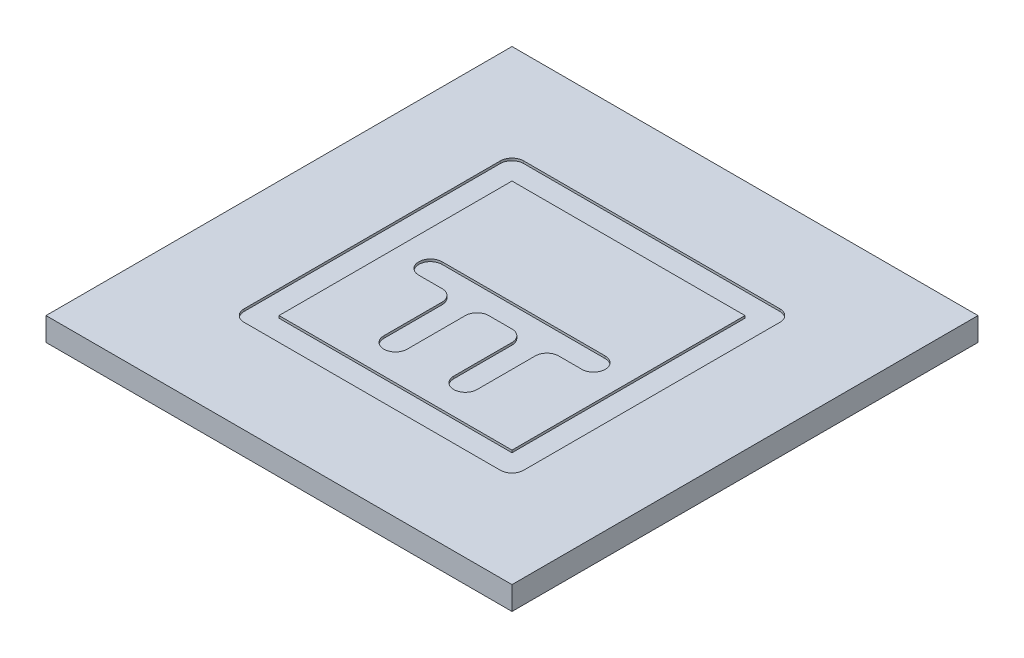
ISO-10303-21;
HEADER;
FILE_DESCRIPTION(('STEP AP214'),'2;1');
FILE_NAME('part.step','',(''),(''),'','','');
FILE_SCHEMA(('AUTOMOTIVE_DESIGN { 1 0 10303 214 1 1 1 1 }'));
ENDSEC;
DATA;
#1=APPLICATION_CONTEXT('core data for automotive mechanical design processes');
#2=APPLICATION_PROTOCOL_DEFINITION('international standard','automotive_design',2000,#1);
#3=PRODUCT_CONTEXT('',#1,'mechanical');
#4=PRODUCT('Part','Part','',(#3));
#5=PRODUCT_RELATED_PRODUCT_CATEGORY('part','',(#4));
#6=PRODUCT_DEFINITION_FORMATION('','',#4);
#7=PRODUCT_DEFINITION_CONTEXT('part definition',#1,'design');
#8=PRODUCT_DEFINITION('design','',#6,#7);
#9=PRODUCT_DEFINITION_SHAPE('','',#8);
#10=(LENGTH_UNIT() NAMED_UNIT(*) SI_UNIT(.MILLI.,.METRE.));
#11=(NAMED_UNIT(*) PLANE_ANGLE_UNIT() SI_UNIT($,.RADIAN.));
#12=(NAMED_UNIT(*) SI_UNIT($,.STERADIAN.) SOLID_ANGLE_UNIT());
#13=UNCERTAINTY_MEASURE_WITH_UNIT(LENGTH_MEASURE(1.E-05),#10,'distance_accuracy_value','');
#14=(GEOMETRIC_REPRESENTATION_CONTEXT(3) GLOBAL_UNCERTAINTY_ASSIGNED_CONTEXT((#13)) GLOBAL_UNIT_ASSIGNED_CONTEXT((#10,
#11,#12)) REPRESENTATION_CONTEXT('',''));
#15=CARTESIAN_POINT('',(0.,0.,0.));
#16=DIRECTION('',(0.,0.,1.));
#17=DIRECTION('',(1.,0.,0.));
#18=AXIS2_PLACEMENT_3D('',#15,#16,#17);
#19=CARTESIAN_POINT('',(0.,10.,0.));
#20=DIRECTION('',(0.,1.,0.));
#21=DIRECTION('',(0.,0.,1.));
#22=AXIS2_PLACEMENT_3D('',#19,#20,#21);
#23=PLANE('',#22);
#24=DIRECTION('',(0.,0.,1.));
#25=VECTOR('',#24,1.);
#26=CARTESIAN_POINT('',(-100.,10.,100.));
#27=LINE('',#26,#25);
#28=CARTESIAN_POINT('',(-100.,10.,-100.));
#29=VERTEX_POINT('',#28);
#30=CARTESIAN_POINT('',(-100.,10.,100.));
#31=VERTEX_POINT('',#30);
#32=EDGE_CURVE('E432',#29,#31,#27,.T.);
#33=ORIENTED_EDGE('',*,*,#32,.T.);
#34=DIRECTION('',(1.,0.,0.));
#35=VECTOR('',#34,1.);
#36=CARTESIAN_POINT('',(100.,10.,100.));
#37=LINE('',#36,#35);
#38=CARTESIAN_POINT('',(100.,10.,100.));
#39=VERTEX_POINT('',#38);
#40=EDGE_CURVE('E435',#31,#39,#37,.T.);
#41=ORIENTED_EDGE('',*,*,#40,.T.);
#42=DIRECTION('',(0.,0.,-1.));
#43=VECTOR('',#42,1.);
#44=CARTESIAN_POINT('',(100.,10.,100.));
#45=LINE('',#44,#43);
#46=CARTESIAN_POINT('',(100.,10.,-100.));
#47=VERTEX_POINT('',#46);
#48=EDGE_CURVE('E438',#39,#47,#45,.T.);
#49=ORIENTED_EDGE('',*,*,#48,.T.);
#50=DIRECTION('',(-1.,0.,0.));
#51=VECTOR('',#50,1.);
#52=CARTESIAN_POINT('',(100.,10.,-100.));
#53=LINE('',#52,#51);
#54=EDGE_CURVE('E440',#47,#29,#53,.T.);
#55=ORIENTED_EDGE('',*,*,#54,.T.);
#56=EDGE_LOOP('',(#33,#41,#49,#55));
#57=FACE_BOUND('',#56,.T.);
#58=DIRECTION('',(0.,0.,-1.));
#59=VECTOR('',#58,1.);
#60=CARTESIAN_POINT('',(60.,10.,0.));
#61=LINE('',#60,#59);
#62=CARTESIAN_POINT('',(60.,10.,55.));
#63=VERTEX_POINT('',#62);
#64=CARTESIAN_POINT('',(60.,10.,-55.));
#65=VERTEX_POINT('',#64);
#66=EDGE_CURVE('E326',#63,#65,#61,.T.);
#67=ORIENTED_EDGE('',*,*,#66,.F.);
#68=CARTESIAN_POINT('',(55.,10.,55.));
#69=DIRECTION('',(0.,1.,0.));
#70=DIRECTION('',(0.,0.,1.));
#71=AXIS2_PLACEMENT_3D('',#68,#69,#70);
#72=CIRCLE('',#71,5.);
#73=CARTESIAN_POINT('',(55.,10.,60.));
#74=VERTEX_POINT('',#73);
#75=EDGE_CURVE('E526',#63,#74,#72,.F.);
#76=ORIENTED_EDGE('',*,*,#75,.T.);
#77=DIRECTION('',(-1.,0.,0.));
#78=VECTOR('',#77,1.);
#79=CARTESIAN_POINT('',(0.,10.,60.));
#80=LINE('',#79,#78);
#81=CARTESIAN_POINT('',(-55.,10.,60.));
#82=VERTEX_POINT('',#81);
#83=EDGE_CURVE('E323',#74,#82,#80,.T.);
#84=ORIENTED_EDGE('',*,*,#83,.T.);
#85=CARTESIAN_POINT('',(-55.,10.,55.));
#86=DIRECTION('',(0.,1.,0.));
#87=DIRECTION('',(0.,0.,1.));
#88=AXIS2_PLACEMENT_3D('',#85,#86,#87);
#89=CIRCLE('',#88,5.);
#90=CARTESIAN_POINT('',(-60.,10.,55.));
#91=VERTEX_POINT('',#90);
#92=EDGE_CURVE('E524',#82,#91,#89,.F.);
#93=ORIENTED_EDGE('',*,*,#92,.T.);
#94=DIRECTION('',(0.,0.,-1.));
#95=VECTOR('',#94,1.);
#96=CARTESIAN_POINT('',(-60.,10.,0.));
#97=LINE('',#96,#95);
#98=CARTESIAN_POINT('',(-60.,10.,-55.));
#99=VERTEX_POINT('',#98);
#100=EDGE_CURVE('E321',#91,#99,#97,.T.);
#101=ORIENTED_EDGE('',*,*,#100,.T.);
#102=CARTESIAN_POINT('',(-55.,10.,-55.));
#103=DIRECTION('',(0.,1.,0.));
#104=DIRECTION('',(0.,0.,1.));
#105=AXIS2_PLACEMENT_3D('',#102,#103,#104);
#106=CIRCLE('',#105,5.);
#107=CARTESIAN_POINT('',(-55.,10.,-60.));
#108=VERTEX_POINT('',#107);
#109=EDGE_CURVE('E12',#99,#108,#106,.F.);
#110=ORIENTED_EDGE('',*,*,#109,.T.);
#111=DIRECTION('',(-1.,0.,0.));
#112=VECTOR('',#111,1.);
#113=CARTESIAN_POINT('',(0.,10.,-60.));
#114=LINE('',#113,#112);
#115=CARTESIAN_POINT('',(55.,10.,-60.));
#116=VERTEX_POINT('',#115);
#117=EDGE_CURVE('E329',#116,#108,#114,.T.);
#118=ORIENTED_EDGE('',*,*,#117,.F.);
#119=CARTESIAN_POINT('',(55.,10.,-55.));
#120=DIRECTION('',(0.,1.,0.));
#121=DIRECTION('',(0.,0.,1.));
#122=AXIS2_PLACEMENT_3D('',#119,#120,#121);
#123=CIRCLE('',#122,5.);
#124=EDGE_CURVE('E89',#116,#65,#123,.F.);
#125=ORIENTED_EDGE('',*,*,#124,.T.);
#126=EDGE_LOOP('',(#67,#76,#84,#93,#101,#110,#118,#125));
#127=FACE_BOUND('',#126,.T.);
#128=ADVANCED_FACE('F81',(#57,#127),#23,.T.);
#129=CARTESIAN_POINT('',(-100.,10.,100.));
#130=DIRECTION('',(1.,0.,0.));
#131=DIRECTION('',(0.,0.,-1.));
#132=AXIS2_PLACEMENT_3D('',#129,#130,#131);
#133=PLANE('',#132);
#134=DIRECTION('',(0.,0.,1.));
#135=VECTOR('',#134,1.);
#136=CARTESIAN_POINT('',(-100.,0.,100.));
#137=LINE('',#136,#135);
#138=CARTESIAN_POINT('',(-100.,0.,-100.));
#139=VERTEX_POINT('',#138);
#140=CARTESIAN_POINT('',(-100.,0.,100.));
#141=VERTEX_POINT('',#140);
#142=EDGE_CURVE('E413',#139,#141,#137,.T.);
#143=ORIENTED_EDGE('',*,*,#142,.T.);
#144=DIRECTION('',(0.,-1.,0.));
#145=VECTOR('',#144,1.);
#146=CARTESIAN_POINT('',(-100.,10.,100.));
#147=LINE('',#146,#145);
#148=EDGE_CURVE('E458',#31,#141,#147,.T.);
#149=ORIENTED_EDGE('',*,*,#148,.F.);
#150=ORIENTED_EDGE('',*,*,#32,.F.);
#151=DIRECTION('',(0.,-1.,0.));
#152=VECTOR('',#151,1.);
#153=CARTESIAN_POINT('',(-100.,10.,-100.));
#154=LINE('',#153,#152);
#155=EDGE_CURVE('E442',#29,#139,#154,.T.);
#156=ORIENTED_EDGE('',*,*,#155,.T.);
#157=EDGE_LOOP('',(#143,#149,#150,#156));
#158=FACE_BOUND('',#157,.T.);
#159=ADVANCED_FACE('F574',(#158),#133,.F.);
#160=CARTESIAN_POINT('',(100.,10.,100.));
#161=DIRECTION('',(0.,0.,-1.));
#162=DIRECTION('',(-1.,0.,0.));
#163=AXIS2_PLACEMENT_3D('',#160,#161,#162);
#164=PLANE('',#163);
#165=DIRECTION('',(1.,0.,0.));
#166=VECTOR('',#165,1.);
#167=CARTESIAN_POINT('',(100.,0.,100.));
#168=LINE('',#167,#166);
#169=CARTESIAN_POINT('',(100.,0.,100.));
#170=VERTEX_POINT('',#169);
#171=EDGE_CURVE('E445',#141,#170,#168,.T.);
#172=ORIENTED_EDGE('',*,*,#171,.T.);
#173=DIRECTION('',(0.,-1.,0.));
#174=VECTOR('',#173,1.);
#175=CARTESIAN_POINT('',(100.,10.,100.));
#176=LINE('',#175,#174);
#177=EDGE_CURVE('E455',#39,#170,#176,.T.);
#178=ORIENTED_EDGE('',*,*,#177,.F.);
#179=ORIENTED_EDGE('',*,*,#40,.F.);
#180=ORIENTED_EDGE('',*,*,#148,.T.);
#181=EDGE_LOOP('',(#172,#178,#179,#180));
#182=FACE_BOUND('',#181,.T.);
#183=ADVANCED_FACE('F581',(#182),#164,.F.);
#184=CARTESIAN_POINT('',(100.,10.,100.));
#185=DIRECTION('',(-1.,0.,0.));
#186=DIRECTION('',(0.,0.,1.));
#187=AXIS2_PLACEMENT_3D('',#184,#185,#186);
#188=PLANE('',#187);
#189=DIRECTION('',(0.,0.,-1.));
#190=VECTOR('',#189,1.);
#191=CARTESIAN_POINT('',(100.,0.,100.));
#192=LINE('',#191,#190);
#193=CARTESIAN_POINT('',(100.,0.,-100.));
#194=VERTEX_POINT('',#193);
#195=EDGE_CURVE('E447',#170,#194,#192,.T.);
#196=ORIENTED_EDGE('',*,*,#195,.T.);
#197=DIRECTION('',(0.,-1.,0.));
#198=VECTOR('',#197,1.);
#199=CARTESIAN_POINT('',(100.,10.,-100.));
#200=LINE('',#199,#198);
#201=EDGE_CURVE('E452',#47,#194,#200,.T.);
#202=ORIENTED_EDGE('',*,*,#201,.F.);
#203=ORIENTED_EDGE('',*,*,#48,.F.);
#204=ORIENTED_EDGE('',*,*,#177,.T.);
#205=EDGE_LOOP('',(#196,#202,#203,#204));
#206=FACE_BOUND('',#205,.T.);
#207=ADVANCED_FACE('F782',(#206),#188,.F.);
#208=CARTESIAN_POINT('',(100.,10.,-100.));
#209=DIRECTION('',(0.,0.,1.));
#210=DIRECTION('',(1.,0.,0.));
#211=AXIS2_PLACEMENT_3D('',#208,#209,#210);
#212=PLANE('',#211);
#213=DIRECTION('',(-1.,0.,0.));
#214=VECTOR('',#213,1.);
#215=CARTESIAN_POINT('',(100.,0.,-100.));
#216=LINE('',#215,#214);
#217=EDGE_CURVE('E436',#194,#139,#216,.T.);
#218=ORIENTED_EDGE('',*,*,#217,.T.);
#219=ORIENTED_EDGE('',*,*,#155,.F.);
#220=ORIENTED_EDGE('',*,*,#54,.F.);
#221=ORIENTED_EDGE('',*,*,#201,.T.);
#222=EDGE_LOOP('',(#218,#219,#220,#221));
#223=FACE_BOUND('',#222,.T.);
#224=ADVANCED_FACE('F786',(#223),#212,.F.);
#225=CARTESIAN_POINT('',(0.,0.,0.));
#226=DIRECTION('',(0.,1.,0.));
#227=DIRECTION('',(0.,0.,1.));
#228=AXIS2_PLACEMENT_3D('',#225,#226,#227);
#229=PLANE('',#228);
#230=ORIENTED_EDGE('',*,*,#142,.F.);
#231=ORIENTED_EDGE('',*,*,#217,.F.);
#232=ORIENTED_EDGE('',*,*,#195,.F.);
#233=ORIENTED_EDGE('',*,*,#171,.F.);
#234=EDGE_LOOP('',(#230,#231,#232,#233));
#235=FACE_BOUND('',#234,.T.);
#236=ADVANCED_FACE('F789',(#235),#229,.F.);
#237=CARTESIAN_POINT('',(0.,9.,50.));
#238=DIRECTION('',(0.,0.,-1.));
#239=DIRECTION('',(-1.,0.,0.));
#240=AXIS2_PLACEMENT_3D('',#237,#238,#239);
#241=PLANE('',#240);
#242=DIRECTION('',(-1.,0.,0.));
#243=VECTOR('',#242,1.);
#244=CARTESIAN_POINT('',(0.,10.,50.));
#245=LINE('',#244,#243);
#246=CARTESIAN_POINT('',(50.,10.,50.));
#247=VERTEX_POINT('',#246);
#248=CARTESIAN_POINT('',(-50.,10.,50.));
#249=VERTEX_POINT('',#248);
#250=EDGE_CURVE('E295',#247,#249,#245,.T.);
#251=ORIENTED_EDGE('',*,*,#250,.T.);
#252=DIRECTION('',(0.,1.,0.));
#253=VECTOR('',#252,1.);
#254=CARTESIAN_POINT('',(-50.,9.,50.));
#255=LINE('',#254,#253);
#256=CARTESIAN_POINT('',(-50.,9.,50.));
#257=VERTEX_POINT('',#256);
#258=EDGE_CURVE('E289',#257,#249,#255,.T.);
#259=ORIENTED_EDGE('',*,*,#258,.F.);
#260=DIRECTION('',(-1.,0.,0.));
#261=VECTOR('',#260,1.);
#262=CARTESIAN_POINT('',(0.,9.,50.));
#263=LINE('',#262,#261);
#264=CARTESIAN_POINT('',(50.,9.,50.));
#265=VERTEX_POINT('',#264);
#266=EDGE_CURVE('E293',#265,#257,#263,.T.);
#267=ORIENTED_EDGE('',*,*,#266,.F.);
#268=DIRECTION('',(0.,1.,0.));
#269=VECTOR('',#268,1.);
#270=CARTESIAN_POINT('',(50.,9.,50.));
#271=LINE('',#270,#269);
#272=EDGE_CURVE('E341',#265,#247,#271,.T.);
#273=ORIENTED_EDGE('',*,*,#272,.T.);
#274=EDGE_LOOP('',(#251,#259,#267,#273));
#275=FACE_BOUND('',#274,.T.);
#276=ADVANCED_FACE('F291',(#275),#241,.F.);
#277=CARTESIAN_POINT('',(50.,9.,0.));
#278=DIRECTION('',(1.,0.,0.));
#279=DIRECTION('',(0.,0.,-1.));
#280=AXIS2_PLACEMENT_3D('',#277,#278,#279);
#281=PLANE('',#280);
#282=DIRECTION('',(0.,0.,-1.));
#283=VECTOR('',#282,1.);
#284=CARTESIAN_POINT('',(50.,10.,0.));
#285=LINE('',#284,#283);
#286=CARTESIAN_POINT('',(50.,10.,-50.));
#287=VERTEX_POINT('',#286);
#288=EDGE_CURVE('E337',#247,#287,#285,.T.);
#289=ORIENTED_EDGE('',*,*,#288,.F.);
#290=ORIENTED_EDGE('',*,*,#272,.F.);
#291=DIRECTION('',(0.,0.,-1.));
#292=VECTOR('',#291,1.);
#293=CARTESIAN_POINT('',(50.,9.,0.));
#294=LINE('',#293,#292);
#295=CARTESIAN_POINT('',(50.,9.,-50.));
#296=VERTEX_POINT('',#295);
#297=EDGE_CURVE('E300',#265,#296,#294,.T.);
#298=ORIENTED_EDGE('',*,*,#297,.T.);
#299=DIRECTION('',(0.,1.,0.));
#300=VECTOR('',#299,1.);
#301=CARTESIAN_POINT('',(50.,9.,-50.));
#302=LINE('',#301,#300);
#303=EDGE_CURVE('E344',#296,#287,#302,.T.);
#304=ORIENTED_EDGE('',*,*,#303,.T.);
#305=EDGE_LOOP('',(#289,#290,#298,#304));
#306=FACE_BOUND('',#305,.T.);
#307=ADVANCED_FACE('F796',(#306),#281,.T.);
#308=CARTESIAN_POINT('',(0.,9.,-50.));
#309=DIRECTION('',(0.,0.,-1.));
#310=DIRECTION('',(-1.,0.,0.));
#311=AXIS2_PLACEMENT_3D('',#308,#309,#310);
#312=PLANE('',#311);
#313=DIRECTION('',(-1.,0.,0.));
#314=VECTOR('',#313,1.);
#315=CARTESIAN_POINT('',(0.,10.,-50.));
#316=LINE('',#315,#314);
#317=CARTESIAN_POINT('',(-50.,10.,-50.));
#318=VERTEX_POINT('',#317);
#319=EDGE_CURVE('E334',#287,#318,#316,.T.);
#320=ORIENTED_EDGE('',*,*,#319,.F.);
#321=ORIENTED_EDGE('',*,*,#303,.F.);
#322=DIRECTION('',(-1.,0.,0.));
#323=VECTOR('',#322,1.);
#324=CARTESIAN_POINT('',(0.,9.,-50.));
#325=LINE('',#324,#323);
#326=CARTESIAN_POINT('',(-50.,9.,-50.));
#327=VERTEX_POINT('',#326);
#328=EDGE_CURVE('E307',#296,#327,#325,.T.);
#329=ORIENTED_EDGE('',*,*,#328,.T.);
#330=DIRECTION('',(0.,1.,0.));
#331=VECTOR('',#330,1.);
#332=CARTESIAN_POINT('',(-50.,9.,-50.));
#333=LINE('',#332,#331);
#334=EDGE_CURVE('E299',#327,#318,#333,.T.);
#335=ORIENTED_EDGE('',*,*,#334,.T.);
#336=EDGE_LOOP('',(#320,#321,#329,#335));
#337=FACE_BOUND('',#336,.T.);
#338=ADVANCED_FACE('F811',(#337),#312,.T.);
#339=CARTESIAN_POINT('',(-60.,9.,0.));
#340=DIRECTION('',(1.,0.,0.));
#341=DIRECTION('',(0.,0.,-1.));
#342=AXIS2_PLACEMENT_3D('',#339,#340,#341);
#343=PLANE('',#342);
#344=ORIENTED_EDGE('',*,*,#100,.F.);
#345=DIRECTION('',(0.,1.,0.));
#346=VECTOR('',#345,1.);
#347=CARTESIAN_POINT('',(-60.,9.,55.));
#348=LINE('',#347,#346);
#349=CARTESIAN_POINT('',(-60.,9.,55.));
#350=VERTEX_POINT('',#349);
#351=EDGE_CURVE('E497',#91,#350,#348,.F.);
#352=ORIENTED_EDGE('',*,*,#351,.T.);
#353=DIRECTION('',(0.,0.,-1.));
#354=VECTOR('',#353,1.);
#355=CARTESIAN_POINT('',(-60.,9.,0.));
#356=LINE('',#355,#354);
#357=CARTESIAN_POINT('',(-60.,9.,-55.));
#358=VERTEX_POINT('',#357);
#359=EDGE_CURVE('E340',#350,#358,#356,.T.);
#360=ORIENTED_EDGE('',*,*,#359,.T.);
#361=DIRECTION('',(0.,1.,0.));
#362=VECTOR('',#361,1.);
#363=CARTESIAN_POINT('',(-60.,9.,-55.));
#364=LINE('',#363,#362);
#365=EDGE_CURVE('E494',#358,#99,#364,.T.);
#366=ORIENTED_EDGE('',*,*,#365,.T.);
#367=EDGE_LOOP('',(#344,#352,#360,#366));
#368=FACE_BOUND('',#367,.T.);
#369=ADVANCED_FACE('F548',(#368),#343,.T.);
#370=CARTESIAN_POINT('',(0.,9.,-60.));
#371=DIRECTION('',(0.,0.,-1.));
#372=DIRECTION('',(-1.,0.,0.));
#373=AXIS2_PLACEMENT_3D('',#370,#371,#372);
#374=PLANE('',#373);
#375=DIRECTION('',(-1.,0.,0.));
#376=VECTOR('',#375,1.);
#377=CARTESIAN_POINT('',(0.,9.,-60.));
#378=LINE('',#377,#376);
#379=CARTESIAN_POINT('',(55.,9.,-60.));
#380=VERTEX_POINT('',#379);
#381=CARTESIAN_POINT('',(-55.,9.,-60.));
#382=VERTEX_POINT('',#381);
#383=EDGE_CURVE('E312',#380,#382,#378,.T.);
#384=ORIENTED_EDGE('',*,*,#383,.F.);
#385=DIRECTION('',(0.,1.,0.));
#386=VECTOR('',#385,1.);
#387=CARTESIAN_POINT('',(55.,10.,-60.));
#388=LINE('',#387,#386);
#389=EDGE_CURVE('E514',#380,#116,#388,.T.);
#390=ORIENTED_EDGE('',*,*,#389,.T.);
#391=ORIENTED_EDGE('',*,*,#117,.T.);
#392=DIRECTION('',(0.,1.,0.));
#393=VECTOR('',#392,1.);
#394=CARTESIAN_POINT('',(-55.,9.,-60.));
#395=LINE('',#394,#393);
#396=EDGE_CURVE('E512',#108,#382,#395,.F.);
#397=ORIENTED_EDGE('',*,*,#396,.T.);
#398=EDGE_LOOP('',(#384,#390,#391,#397));
#399=FACE_BOUND('',#398,.T.);
#400=ADVANCED_FACE('F540',(#399),#374,.F.);
#401=CARTESIAN_POINT('',(60.,9.,0.));
#402=DIRECTION('',(1.,0.,0.));
#403=DIRECTION('',(0.,0.,-1.));
#404=AXIS2_PLACEMENT_3D('',#401,#402,#403);
#405=PLANE('',#404);
#406=DIRECTION('',(0.,0.,-1.));
#407=VECTOR('',#406,1.);
#408=CARTESIAN_POINT('',(60.,9.,0.));
#409=LINE('',#408,#407);
#410=CARTESIAN_POINT('',(60.,9.,55.));
#411=VERTEX_POINT('',#410);
#412=CARTESIAN_POINT('',(60.,9.,-55.));
#413=VERTEX_POINT('',#412);
#414=EDGE_CURVE('E315',#411,#413,#409,.T.);
#415=ORIENTED_EDGE('',*,*,#414,.F.);
#416=DIRECTION('',(0.,1.,0.));
#417=VECTOR('',#416,1.);
#418=CARTESIAN_POINT('',(60.,9.,55.));
#419=LINE('',#418,#417);
#420=EDGE_CURVE('E509',#411,#63,#419,.T.);
#421=ORIENTED_EDGE('',*,*,#420,.T.);
#422=ORIENTED_EDGE('',*,*,#66,.T.);
#423=DIRECTION('',(0.,1.,0.));
#424=VECTOR('',#423,1.);
#425=CARTESIAN_POINT('',(60.,9.,-55.));
#426=LINE('',#425,#424);
#427=EDGE_CURVE('E507',#65,#413,#426,.F.);
#428=ORIENTED_EDGE('',*,*,#427,.T.);
#429=EDGE_LOOP('',(#415,#421,#422,#428));
#430=FACE_BOUND('',#429,.T.);
#431=ADVANCED_FACE('F530',(#430),#405,.F.);
#432=CARTESIAN_POINT('',(0.,9.,60.));
#433=DIRECTION('',(0.,0.,-1.));
#434=DIRECTION('',(-1.,0.,0.));
#435=AXIS2_PLACEMENT_3D('',#432,#433,#434);
#436=PLANE('',#435);
#437=DIRECTION('',(-1.,0.,0.));
#438=VECTOR('',#437,1.);
#439=CARTESIAN_POINT('',(0.,9.,60.));
#440=LINE('',#439,#438);
#441=CARTESIAN_POINT('',(55.,9.,60.));
#442=VERTEX_POINT('',#441);
#443=CARTESIAN_POINT('',(-55.,9.,60.));
#444=VERTEX_POINT('',#443);
#445=EDGE_CURVE('E550',#442,#444,#440,.T.);
#446=ORIENTED_EDGE('',*,*,#445,.T.);
#447=DIRECTION('',(0.,1.,0.));
#448=VECTOR('',#447,1.);
#449=CARTESIAN_POINT('',(-55.,10.,60.));
#450=LINE('',#449,#448);
#451=EDGE_CURVE('E491',#444,#82,#450,.T.);
#452=ORIENTED_EDGE('',*,*,#451,.T.);
#453=ORIENTED_EDGE('',*,*,#83,.F.);
#454=DIRECTION('',(0.,1.,0.));
#455=VECTOR('',#454,1.);
#456=CARTESIAN_POINT('',(55.,9.,60.));
#457=LINE('',#456,#455);
#458=EDGE_CURVE('E489',#74,#442,#457,.F.);
#459=ORIENTED_EDGE('',*,*,#458,.T.);
#460=EDGE_LOOP('',(#446,#452,#453,#459));
#461=FACE_BOUND('',#460,.T.);
#462=ADVANCED_FACE('F557',(#461),#436,.T.);
#463=CARTESIAN_POINT('',(-50.,9.,0.));
#464=DIRECTION('',(1.,0.,0.));
#465=DIRECTION('',(0.,0.,-1.));
#466=AXIS2_PLACEMENT_3D('',#463,#464,#465);
#467=PLANE('',#466);
#468=DIRECTION('',(0.,0.,-1.));
#469=VECTOR('',#468,1.);
#470=CARTESIAN_POINT('',(-50.,10.,0.));
#471=LINE('',#470,#469);
#472=EDGE_CURVE('E332',#249,#318,#471,.T.);
#473=ORIENTED_EDGE('',*,*,#472,.T.);
#474=ORIENTED_EDGE('',*,*,#334,.F.);
#475=DIRECTION('',(0.,0.,-1.));
#476=VECTOR('',#475,1.);
#477=CARTESIAN_POINT('',(-50.,9.,0.));
#478=LINE('',#477,#476);
#479=EDGE_CURVE('E304',#257,#327,#478,.T.);
#480=ORIENTED_EDGE('',*,*,#479,.F.);
#481=ORIENTED_EDGE('',*,*,#258,.T.);
#482=EDGE_LOOP('',(#473,#474,#480,#481));
#483=FACE_BOUND('',#482,.T.);
#484=ADVANCED_FACE('F305',(#483),#467,.F.);
#485=CARTESIAN_POINT('',(0.,9.,0.));
#486=DIRECTION('',(0.,1.,0.));
#487=DIRECTION('',(0.,0.,1.));
#488=AXIS2_PLACEMENT_3D('',#485,#486,#487);
#489=PLANE('',#488);
#490=ORIENTED_EDGE('',*,*,#359,.F.);
#491=CARTESIAN_POINT('',(-55.,9.,55.));
#492=DIRECTION('',(0.,1.,0.));
#493=DIRECTION('',(0.,0.,1.));
#494=AXIS2_PLACEMENT_3D('',#491,#492,#493);
#495=CIRCLE('',#494,5.);
#496=EDGE_CURVE('E505',#350,#444,#495,.T.);
#497=ORIENTED_EDGE('',*,*,#496,.T.);
#498=ORIENTED_EDGE('',*,*,#445,.F.);
#499=CARTESIAN_POINT('',(55.,9.,55.));
#500=DIRECTION('',(0.,1.,0.));
#501=DIRECTION('',(0.,0.,1.));
#502=AXIS2_PLACEMENT_3D('',#499,#500,#501);
#503=CIRCLE('',#502,5.);
#504=EDGE_CURVE('E503',#442,#411,#503,.T.);
#505=ORIENTED_EDGE('',*,*,#504,.T.);
#506=ORIENTED_EDGE('',*,*,#414,.T.);
#507=CARTESIAN_POINT('',(55.,9.,-55.));
#508=DIRECTION('',(0.,1.,0.));
#509=DIRECTION('',(0.,0.,1.));
#510=AXIS2_PLACEMENT_3D('',#507,#508,#509);
#511=CIRCLE('',#510,5.);
#512=EDGE_CURVE('E501',#413,#380,#511,.T.);
#513=ORIENTED_EDGE('',*,*,#512,.T.);
#514=ORIENTED_EDGE('',*,*,#383,.T.);
#515=CARTESIAN_POINT('',(-55.,9.,-55.));
#516=DIRECTION('',(0.,1.,0.));
#517=DIRECTION('',(0.,0.,1.));
#518=AXIS2_PLACEMENT_3D('',#515,#516,#517);
#519=CIRCLE('',#518,5.);
#520=EDGE_CURVE('E499',#382,#358,#519,.T.);
#521=ORIENTED_EDGE('',*,*,#520,.T.);
#522=EDGE_LOOP('',(#490,#497,#498,#505,#506,#513,#514,#521));
#523=FACE_BOUND('',#522,.T.);
#524=ORIENTED_EDGE('',*,*,#266,.T.);
#525=ORIENTED_EDGE('',*,*,#479,.T.);
#526=ORIENTED_EDGE('',*,*,#328,.F.);
#527=ORIENTED_EDGE('',*,*,#297,.F.);
#528=EDGE_LOOP('',(#524,#525,#526,#527));
#529=FACE_BOUND('',#528,.T.);
#530=ADVANCED_FACE('F310',(#523,#529),#489,.T.);
#531=CARTESIAN_POINT('',(0.,9.,0.));
#532=DIRECTION('',(0.,1.,0.));
#533=DIRECTION('',(0.,0.,1.));
#534=AXIS2_PLACEMENT_3D('',#531,#532,#533);
#535=PLANE('',#534);
#536=DIRECTION('',(1.,0.,0.));
#537=VECTOR('',#536,1.);
#538=CARTESIAN_POINT('',(0.,9.,-4.99999999999999));
#539=LINE('',#538,#537);
#540=CARTESIAN_POINT('',(-35.,9.,-5.));
#541=VERTEX_POINT('',#540);
#542=CARTESIAN_POINT('',(35.,9.,-4.99999999999997));
#543=VERTEX_POINT('',#542);
#544=EDGE_CURVE('E348',#541,#543,#539,.T.);
#545=ORIENTED_EDGE('',*,*,#544,.F.);
#546=CARTESIAN_POINT('',(-35.,9.,0.));
#547=DIRECTION('',(0.,1.,0.));
#548=DIRECTION('',(0.,0.,1.));
#549=AXIS2_PLACEMENT_3D('',#546,#547,#548);
#550=CIRCLE('',#549,5.);
#551=CARTESIAN_POINT('',(-34.9999999999999,9.,5.));
#552=VERTEX_POINT('',#551);
#553=EDGE_CURVE('E350',#541,#552,#550,.T.);
#554=ORIENTED_EDGE('',*,*,#553,.T.);
#555=DIRECTION('',(1.,0.,0.));
#556=VECTOR('',#555,1.);
#557=CARTESIAN_POINT('',(0.,9.,5.00000000000002));
#558=LINE('',#557,#556);
#559=CARTESIAN_POINT('',(-25.,9.,5.00000000000001));
#560=VERTEX_POINT('',#559);
#561=EDGE_CURVE('E354',#552,#560,#558,.T.);
#562=ORIENTED_EDGE('',*,*,#561,.T.);
#563=CARTESIAN_POINT('',(-25.,9.,10.));
#564=DIRECTION('',(0.,1.,0.));
#565=DIRECTION('',(0.,0.,1.));
#566=AXIS2_PLACEMENT_3D('',#563,#564,#565);
#567=CIRCLE('',#566,5.);
#568=CARTESIAN_POINT('',(-20.,9.,10.));
#569=VERTEX_POINT('',#568);
#570=EDGE_CURVE('E522',#560,#569,#567,.F.);
#571=ORIENTED_EDGE('',*,*,#570,.T.);
#572=DIRECTION('',(0.,0.,1.));
#573=VECTOR('',#572,1.);
#574=CARTESIAN_POINT('',(-20.,9.,0.));
#575=LINE('',#574,#573);
#576=CARTESIAN_POINT('',(-20.,9.,35.));
#577=VERTEX_POINT('',#576);
#578=EDGE_CURVE('E357',#569,#577,#575,.T.);
#579=ORIENTED_EDGE('',*,*,#578,.T.);
#580=CARTESIAN_POINT('',(-15.,9.,35.));
#581=DIRECTION('',(0.,1.,0.));
#582=DIRECTION('',(0.,0.,1.));
#583=AXIS2_PLACEMENT_3D('',#580,#581,#582);
#584=CIRCLE('',#583,5.00000000000002);
#585=CARTESIAN_POINT('',(-9.99999999999995,9.,35.));
#586=VERTEX_POINT('',#585);
#587=EDGE_CURVE('E359',#577,#586,#584,.T.);
#588=ORIENTED_EDGE('',*,*,#587,.T.);
#589=DIRECTION('',(0.,0.,1.));
#590=VECTOR('',#589,1.);
#591=CARTESIAN_POINT('',(-10.,9.,0.));
#592=LINE('',#591,#590);
#593=CARTESIAN_POINT('',(-9.99999999999999,9.,10.));
#594=VERTEX_POINT('',#593);
#595=EDGE_CURVE('E362',#594,#586,#592,.T.);
#596=ORIENTED_EDGE('',*,*,#595,.F.);
#597=CARTESIAN_POINT('',(-4.99999999999999,9.,10.));
#598=DIRECTION('',(0.,1.,0.));
#599=DIRECTION('',(0.,0.,1.));
#600=AXIS2_PLACEMENT_3D('',#597,#598,#599);
#601=CIRCLE('',#600,5.);
#602=CARTESIAN_POINT('',(-4.99999999999999,9.,5.00000000000001));
#603=VERTEX_POINT('',#602);
#604=EDGE_CURVE('E516',#594,#603,#601,.F.);
#605=ORIENTED_EDGE('',*,*,#604,.T.);
#606=DIRECTION('',(1.,0.,0.));
#607=VECTOR('',#606,1.);
#608=CARTESIAN_POINT('',(0.,9.,5.00000000000002));
#609=LINE('',#608,#607);
#610=CARTESIAN_POINT('',(5.00000000000001,9.,5.00000000000002));
#611=VERTEX_POINT('',#610);
#612=EDGE_CURVE('E364',#603,#611,#609,.T.);
#613=ORIENTED_EDGE('',*,*,#612,.T.);
#614=CARTESIAN_POINT('',(5.00000000000001,9.,10.));
#615=DIRECTION('',(0.,1.,0.));
#616=DIRECTION('',(0.,0.,1.));
#617=AXIS2_PLACEMENT_3D('',#614,#615,#616);
#618=CIRCLE('',#617,5.);
#619=CARTESIAN_POINT('',(10.,9.,10.));
#620=VERTEX_POINT('',#619);
#621=EDGE_CURVE('E518',#611,#620,#618,.F.);
#622=ORIENTED_EDGE('',*,*,#621,.T.);
#623=DIRECTION('',(0.,0.,1.));
#624=VECTOR('',#623,1.);
#625=CARTESIAN_POINT('',(10.,9.,0.));
#626=LINE('',#625,#624);
#627=CARTESIAN_POINT('',(10.,9.,35.));
#628=VERTEX_POINT('',#627);
#629=EDGE_CURVE('E367',#620,#628,#626,.T.);
#630=ORIENTED_EDGE('',*,*,#629,.T.);
#631=CARTESIAN_POINT('',(15.,9.,35.));
#632=DIRECTION('',(0.,1.,0.));
#633=DIRECTION('',(0.,0.,1.));
#634=AXIS2_PLACEMENT_3D('',#631,#632,#633);
#635=CIRCLE('',#634,5.00000000000002);
#636=CARTESIAN_POINT('',(20.0000000000001,9.,35.));
#637=VERTEX_POINT('',#636);
#638=EDGE_CURVE('E369',#628,#637,#635,.T.);
#639=ORIENTED_EDGE('',*,*,#638,.T.);
#640=DIRECTION('',(0.,0.,1.));
#641=VECTOR('',#640,1.);
#642=CARTESIAN_POINT('',(20.,9.,0.));
#643=LINE('',#642,#641);
#644=CARTESIAN_POINT('',(20.,9.,10.));
#645=VERTEX_POINT('',#644);
#646=EDGE_CURVE('E372',#645,#637,#643,.T.);
#647=ORIENTED_EDGE('',*,*,#646,.F.);
#648=CARTESIAN_POINT('',(25.,9.,10.));
#649=DIRECTION('',(0.,1.,0.));
#650=DIRECTION('',(0.,0.,1.));
#651=AXIS2_PLACEMENT_3D('',#648,#649,#650);
#652=CIRCLE('',#651,5.);
#653=CARTESIAN_POINT('',(25.,9.,5.00000000000003));
#654=VERTEX_POINT('',#653);
#655=EDGE_CURVE('E520',#645,#654,#652,.F.);
#656=ORIENTED_EDGE('',*,*,#655,.T.);
#657=DIRECTION('',(-1.,0.,0.));
#658=VECTOR('',#657,1.);
#659=CARTESIAN_POINT('',(0.,9.,5.00000000000002));
#660=LINE('',#659,#658);
#661=CARTESIAN_POINT('',(35.,9.,5.00000000000003));
#662=VERTEX_POINT('',#661);
#663=EDGE_CURVE('E374',#662,#654,#660,.T.);
#664=ORIENTED_EDGE('',*,*,#663,.F.);
#665=CARTESIAN_POINT('',(35.,9.,0.));
#666=DIRECTION('',(0.,1.,0.));
#667=DIRECTION('',(0.,0.,1.));
#668=AXIS2_PLACEMENT_3D('',#665,#666,#667);
#669=CIRCLE('',#668,5.);
#670=EDGE_CURVE('E377',#662,#543,#669,.T.);
#671=ORIENTED_EDGE('',*,*,#670,.T.);
#672=EDGE_LOOP('',(#545,#554,#562,#571,#579,#588,#596,#605,#613,#622,#630,#639,#647,#656,#664,#671));
#673=FACE_BOUND('',#672,.T.);
#674=ADVANCED_FACE('F615',(#673),#535,.T.);
#675=CARTESIAN_POINT('',(0.,9.,5.00000000000002));
#676=DIRECTION('',(0.,0.,1.));
#677=DIRECTION('',(1.,0.,0.));
#678=AXIS2_PLACEMENT_3D('',#675,#676,#677);
#679=PLANE('',#678);
#680=DIRECTION('',(1.,0.,0.));
#681=VECTOR('',#680,1.);
#682=CARTESIAN_POINT('',(0.,10.,5.00000000000002));
#683=LINE('',#682,#681);
#684=CARTESIAN_POINT('',(-34.9999999999999,10.,5.));
#685=VERTEX_POINT('',#684);
#686=CARTESIAN_POINT('',(-25.,10.,5.00000000000001));
#687=VERTEX_POINT('',#686);
#688=EDGE_CURVE('E386',#685,#687,#683,.T.);
#689=ORIENTED_EDGE('',*,*,#688,.T.);
#690=DIRECTION('',(0.,1.,0.));
#691=VECTOR('',#690,1.);
#692=CARTESIAN_POINT('',(-25.,9.,5.00000000000001));
#693=LINE('',#692,#691);
#694=EDGE_CURVE('E487',#687,#560,#693,.F.);
#695=ORIENTED_EDGE('',*,*,#694,.T.);
#696=ORIENTED_EDGE('',*,*,#561,.F.);
#697=DIRECTION('',(0.,1.,0.));
#698=VECTOR('',#697,1.);
#699=CARTESIAN_POINT('',(-34.9999999999999,9.,5.));
#700=LINE('',#699,#698);
#701=EDGE_CURVE('E428',#552,#685,#700,.T.);
#702=ORIENTED_EDGE('',*,*,#701,.T.);
#703=EDGE_LOOP('',(#689,#695,#696,#702));
#704=FACE_BOUND('',#703,.T.);
#705=ADVANCED_FACE('F647',(#704),#679,.F.);
#706=CARTESIAN_POINT('',(-20.,9.,0.));
#707=DIRECTION('',(-1.,0.,0.));
#708=DIRECTION('',(0.,0.,1.));
#709=AXIS2_PLACEMENT_3D('',#706,#707,#708);
#710=PLANE('',#709);
#711=ORIENTED_EDGE('',*,*,#578,.F.);
#712=DIRECTION('',(0.,1.,0.));
#713=VECTOR('',#712,1.);
#714=CARTESIAN_POINT('',(-20.,9.,10.));
#715=LINE('',#714,#713);
#716=CARTESIAN_POINT('',(-20.,10.,10.));
#717=VERTEX_POINT('',#716);
#718=EDGE_CURVE('E484',#569,#717,#715,.T.);
#719=ORIENTED_EDGE('',*,*,#718,.T.);
#720=DIRECTION('',(0.,0.,1.));
#721=VECTOR('',#720,1.);
#722=CARTESIAN_POINT('',(-20.,10.,0.));
#723=LINE('',#722,#721);
#724=CARTESIAN_POINT('',(-20.,10.,35.));
#725=VERTEX_POINT('',#724);
#726=EDGE_CURVE('E389',#717,#725,#723,.T.);
#727=ORIENTED_EDGE('',*,*,#726,.T.);
#728=DIRECTION('',(0.,1.,0.));
#729=VECTOR('',#728,1.);
#730=CARTESIAN_POINT('',(-20.,9.,35.));
#731=LINE('',#730,#729);
#732=EDGE_CURVE('E425',#577,#725,#731,.T.);
#733=ORIENTED_EDGE('',*,*,#732,.F.);
#734=EDGE_LOOP('',(#711,#719,#727,#733));
#735=FACE_BOUND('',#734,.T.);
#736=ADVANCED_FACE('F655',(#735),#710,.F.);
#737=CARTESIAN_POINT('',(-15.,9.,35.));
#738=DIRECTION('',(0.,1.,0.));
#739=DIRECTION('',(0.,0.,1.));
#740=AXIS2_PLACEMENT_3D('',#737,#738,#739);
#741=CYLINDRICAL_SURFACE('',#740,5.00000000000002);
#742=CARTESIAN_POINT('',(-15.,10.,35.));
#743=DIRECTION('',(0.,1.,0.));
#744=DIRECTION('',(0.,0.,1.));
#745=AXIS2_PLACEMENT_3D('',#742,#743,#744);
#746=CIRCLE('',#745,5.00000000000002);
#747=CARTESIAN_POINT('',(-9.99999999999995,10.,35.));
#748=VERTEX_POINT('',#747);
#749=EDGE_CURVE('E391',#725,#748,#746,.T.);
#750=ORIENTED_EDGE('',*,*,#749,.T.);
#751=DIRECTION('',(0.,1.,0.));
#752=VECTOR('',#751,1.);
#753=CARTESIAN_POINT('',(-9.99999999999995,9.,35.));
#754=LINE('',#753,#752);
#755=EDGE_CURVE('E422',#586,#748,#754,.T.);
#756=ORIENTED_EDGE('',*,*,#755,.F.);
#757=ORIENTED_EDGE('',*,*,#587,.F.);
#758=ORIENTED_EDGE('',*,*,#732,.T.);
#759=EDGE_LOOP('',(#750,#756,#757,#758));
#760=FACE_BOUND('',#759,.T.);
#761=ADVANCED_FACE('F660',(#760),#741,.F.);
#762=CARTESIAN_POINT('',(-10.,9.,0.));
#763=DIRECTION('',(-1.,0.,0.));
#764=DIRECTION('',(0.,0.,1.));
#765=AXIS2_PLACEMENT_3D('',#762,#763,#764);
#766=PLANE('',#765);
#767=DIRECTION('',(0.,0.,1.));
#768=VECTOR('',#767,1.);
#769=CARTESIAN_POINT('',(-10.,10.,0.));
#770=LINE('',#769,#768);
#771=CARTESIAN_POINT('',(-9.99999999999999,10.,10.));
#772=VERTEX_POINT('',#771);
#773=EDGE_CURVE('E394',#772,#748,#770,.T.);
#774=ORIENTED_EDGE('',*,*,#773,.F.);
#775=DIRECTION('',(0.,1.,0.));
#776=VECTOR('',#775,1.);
#777=CARTESIAN_POINT('',(-9.99999999999999,9.,10.));
#778=LINE('',#777,#776);
#779=EDGE_CURVE('E474',#772,#594,#778,.F.);
#780=ORIENTED_EDGE('',*,*,#779,.T.);
#781=ORIENTED_EDGE('',*,*,#595,.T.);
#782=ORIENTED_EDGE('',*,*,#755,.T.);
#783=EDGE_LOOP('',(#774,#780,#781,#782));
#784=FACE_BOUND('',#783,.T.);
#785=ADVANCED_FACE('F666',(#784),#766,.T.);
#786=CARTESIAN_POINT('',(0.,9.,5.00000000000002));
#787=DIRECTION('',(0.,0.,1.));
#788=DIRECTION('',(1.,0.,0.));
#789=AXIS2_PLACEMENT_3D('',#786,#787,#788);
#790=PLANE('',#789);
#791=ORIENTED_EDGE('',*,*,#612,.F.);
#792=DIRECTION('',(0.,1.,0.));
#793=VECTOR('',#792,1.);
#794=CARTESIAN_POINT('',(-4.99999999999999,10.,5.00000000000001));
#795=LINE('',#794,#793);
#796=CARTESIAN_POINT('',(-4.99999999999999,10.,5.00000000000001));
#797=VERTEX_POINT('',#796);
#798=EDGE_CURVE('E463',#603,#797,#795,.T.);
#799=ORIENTED_EDGE('',*,*,#798,.T.);
#800=DIRECTION('',(1.,0.,0.));
#801=VECTOR('',#800,1.);
#802=CARTESIAN_POINT('',(0.,10.,5.00000000000002));
#803=LINE('',#802,#801);
#804=CARTESIAN_POINT('',(5.00000000000001,10.,5.00000000000002));
#805=VERTEX_POINT('',#804);
#806=EDGE_CURVE('E396',#797,#805,#803,.T.);
#807=ORIENTED_EDGE('',*,*,#806,.T.);
#808=DIRECTION('',(0.,1.,0.));
#809=VECTOR('',#808,1.);
#810=CARTESIAN_POINT('',(5.00000000000001,9.,5.00000000000002));
#811=LINE('',#810,#809);
#812=EDGE_CURVE('E461',#805,#611,#811,.F.);
#813=ORIENTED_EDGE('',*,*,#812,.T.);
#814=EDGE_LOOP('',(#791,#799,#807,#813));
#815=FACE_BOUND('',#814,.T.);
#816=ADVANCED_FACE('F607',(#815),#790,.F.);
#817=CARTESIAN_POINT('',(10.,9.,0.));
#818=DIRECTION('',(-1.,0.,0.));
#819=DIRECTION('',(0.,0.,1.));
#820=AXIS2_PLACEMENT_3D('',#817,#818,#819);
#821=PLANE('',#820);
#822=ORIENTED_EDGE('',*,*,#629,.F.);
#823=DIRECTION('',(0.,1.,0.));
#824=VECTOR('',#823,1.);
#825=CARTESIAN_POINT('',(10.,9.,10.));
#826=LINE('',#825,#824);
#827=CARTESIAN_POINT('',(10.,10.,10.));
#828=VERTEX_POINT('',#827);
#829=EDGE_CURVE('E476',#620,#828,#826,.T.);
#830=ORIENTED_EDGE('',*,*,#829,.T.);
#831=DIRECTION('',(0.,0.,1.));
#832=VECTOR('',#831,1.);
#833=CARTESIAN_POINT('',(10.,10.,0.));
#834=LINE('',#833,#832);
#835=CARTESIAN_POINT('',(10.,10.,35.));
#836=VERTEX_POINT('',#835);
#837=EDGE_CURVE('E399',#828,#836,#834,.T.);
#838=ORIENTED_EDGE('',*,*,#837,.T.);
#839=DIRECTION('',(0.,1.,0.));
#840=VECTOR('',#839,1.);
#841=CARTESIAN_POINT('',(10.,9.,35.));
#842=LINE('',#841,#840);
#843=EDGE_CURVE('E419',#628,#836,#842,.T.);
#844=ORIENTED_EDGE('',*,*,#843,.F.);
#845=EDGE_LOOP('',(#822,#830,#838,#844));
#846=FACE_BOUND('',#845,.T.);
#847=ADVANCED_FACE('F618',(#846),#821,.F.);
#848=CARTESIAN_POINT('',(15.,9.,35.));
#849=DIRECTION('',(0.,1.,0.));
#850=DIRECTION('',(0.,0.,1.));
#851=AXIS2_PLACEMENT_3D('',#848,#849,#850);
#852=CYLINDRICAL_SURFACE('',#851,5.00000000000002);
#853=CARTESIAN_POINT('',(15.,10.,35.));
#854=DIRECTION('',(0.,1.,0.));
#855=DIRECTION('',(0.,0.,1.));
#856=AXIS2_PLACEMENT_3D('',#853,#854,#855);
#857=CIRCLE('',#856,5.00000000000002);
#858=CARTESIAN_POINT('',(20.0000000000001,10.,35.));
#859=VERTEX_POINT('',#858);
#860=EDGE_CURVE('E401',#836,#859,#857,.T.);
#861=ORIENTED_EDGE('',*,*,#860,.T.);
#862=DIRECTION('',(0.,1.,0.));
#863=VECTOR('',#862,1.);
#864=CARTESIAN_POINT('',(20.0000000000001,9.,35.));
#865=LINE('',#864,#863);
#866=EDGE_CURVE('E416',#637,#859,#865,.T.);
#867=ORIENTED_EDGE('',*,*,#866,.F.);
#868=ORIENTED_EDGE('',*,*,#638,.F.);
#869=ORIENTED_EDGE('',*,*,#843,.T.);
#870=EDGE_LOOP('',(#861,#867,#868,#869));
#871=FACE_BOUND('',#870,.T.);
#872=ADVANCED_FACE('F623',(#871),#852,.F.);
#873=CARTESIAN_POINT('',(20.,9.,0.));
#874=DIRECTION('',(-1.,0.,0.));
#875=DIRECTION('',(0.,0.,1.));
#876=AXIS2_PLACEMENT_3D('',#873,#874,#875);
#877=PLANE('',#876);
#878=DIRECTION('',(0.,0.,1.));
#879=VECTOR('',#878,1.);
#880=CARTESIAN_POINT('',(20.,10.,0.));
#881=LINE('',#880,#879);
#882=CARTESIAN_POINT('',(20.,10.,10.));
#883=VERTEX_POINT('',#882);
#884=EDGE_CURVE('E404',#883,#859,#881,.T.);
#885=ORIENTED_EDGE('',*,*,#884,.F.);
#886=DIRECTION('',(0.,1.,0.));
#887=VECTOR('',#886,1.);
#888=CARTESIAN_POINT('',(20.,9.,10.));
#889=LINE('',#888,#887);
#890=EDGE_CURVE('E482',#883,#645,#889,.F.);
#891=ORIENTED_EDGE('',*,*,#890,.T.);
#892=ORIENTED_EDGE('',*,*,#646,.T.);
#893=ORIENTED_EDGE('',*,*,#866,.T.);
#894=EDGE_LOOP('',(#885,#891,#892,#893));
#895=FACE_BOUND('',#894,.T.);
#896=ADVANCED_FACE('F688',(#895),#877,.T.);
#897=CARTESIAN_POINT('',(0.,9.,5.00000000000002));
#898=DIRECTION('',(0.,0.,-1.));
#899=DIRECTION('',(-1.,0.,0.));
#900=AXIS2_PLACEMENT_3D('',#897,#898,#899);
#901=PLANE('',#900);
#902=ORIENTED_EDGE('',*,*,#663,.T.);
#903=DIRECTION('',(0.,1.,0.));
#904=VECTOR('',#903,1.);
#905=CARTESIAN_POINT('',(25.,9.,5.00000000000003));
#906=LINE('',#905,#904);
#907=CARTESIAN_POINT('',(25.,10.,5.00000000000003));
#908=VERTEX_POINT('',#907);
#909=EDGE_CURVE('E479',#654,#908,#906,.T.);
#910=ORIENTED_EDGE('',*,*,#909,.T.);
#911=DIRECTION('',(-1.,0.,0.));
#912=VECTOR('',#911,1.);
#913=CARTESIAN_POINT('',(0.,10.,5.00000000000002));
#914=LINE('',#913,#912);
#915=CARTESIAN_POINT('',(35.,10.,5.00000000000003));
#916=VERTEX_POINT('',#915);
#917=EDGE_CURVE('E406',#916,#908,#914,.T.);
#918=ORIENTED_EDGE('',*,*,#917,.F.);
#919=DIRECTION('',(0.,1.,0.));
#920=VECTOR('',#919,1.);
#921=CARTESIAN_POINT('',(35.,9.,5.00000000000003));
#922=LINE('',#921,#920);
#923=EDGE_CURVE('E414',#662,#916,#922,.T.);
#924=ORIENTED_EDGE('',*,*,#923,.F.);
#925=EDGE_LOOP('',(#902,#910,#918,#924));
#926=FACE_BOUND('',#925,.T.);
#927=ADVANCED_FACE('F634',(#926),#901,.T.);
#928=CARTESIAN_POINT('',(35.,9.,0.));
#929=DIRECTION('',(0.,1.,0.));
#930=DIRECTION('',(0.,0.,1.));
#931=AXIS2_PLACEMENT_3D('',#928,#929,#930);
#932=CYLINDRICAL_SURFACE('',#931,5.);
#933=CARTESIAN_POINT('',(35.,10.,0.));
#934=DIRECTION('',(0.,1.,0.));
#935=DIRECTION('',(0.,0.,1.));
#936=AXIS2_PLACEMENT_3D('',#933,#934,#935);
#937=CIRCLE('',#936,5.);
#938=CARTESIAN_POINT('',(35.,10.,-4.99999999999997));
#939=VERTEX_POINT('',#938);
#940=EDGE_CURVE('E351',#916,#939,#937,.T.);
#941=ORIENTED_EDGE('',*,*,#940,.T.);
#942=DIRECTION('',(0.,1.,0.));
#943=VECTOR('',#942,1.);
#944=CARTESIAN_POINT('',(35.,9.,-4.99999999999997));
#945=LINE('',#944,#943);
#946=EDGE_CURVE('E411',#543,#939,#945,.T.);
#947=ORIENTED_EDGE('',*,*,#946,.F.);
#948=ORIENTED_EDGE('',*,*,#670,.F.);
#949=ORIENTED_EDGE('',*,*,#923,.T.);
#950=EDGE_LOOP('',(#941,#947,#948,#949));
#951=FACE_BOUND('',#950,.T.);
#952=ADVANCED_FACE('F640',(#951),#932,.F.);
#953=CARTESIAN_POINT('',(0.,9.,-4.99999999999999));
#954=DIRECTION('',(0.,0.,1.));
#955=DIRECTION('',(1.,0.,0.));
#956=AXIS2_PLACEMENT_3D('',#953,#954,#955);
#957=PLANE('',#956);
#958=DIRECTION('',(1.,0.,0.));
#959=VECTOR('',#958,1.);
#960=CARTESIAN_POINT('',(0.,10.,-4.99999999999999));
#961=LINE('',#960,#959);
#962=CARTESIAN_POINT('',(-35.,10.,-5.));
#963=VERTEX_POINT('',#962);
#964=EDGE_CURVE('E343',#963,#939,#961,.T.);
#965=ORIENTED_EDGE('',*,*,#964,.F.);
#966=DIRECTION('',(0.,1.,0.));
#967=VECTOR('',#966,1.);
#968=CARTESIAN_POINT('',(-35.,9.,-5.));
#969=LINE('',#968,#967);
#970=EDGE_CURVE('E380',#541,#963,#969,.T.);
#971=ORIENTED_EDGE('',*,*,#970,.F.);
#972=ORIENTED_EDGE('',*,*,#544,.T.);
#973=ORIENTED_EDGE('',*,*,#946,.T.);
#974=EDGE_LOOP('',(#965,#971,#972,#973));
#975=FACE_BOUND('',#974,.T.);
#976=ADVANCED_FACE('F597',(#975),#957,.T.);
#977=CARTESIAN_POINT('',(-35.,9.,0.));
#978=DIRECTION('',(0.,1.,0.));
#979=DIRECTION('',(0.,0.,1.));
#980=AXIS2_PLACEMENT_3D('',#977,#978,#979);
#981=CYLINDRICAL_SURFACE('',#980,5.);
#982=CARTESIAN_POINT('',(-35.,10.,0.));
#983=DIRECTION('',(0.,1.,0.));
#984=DIRECTION('',(0.,0.,1.));
#985=AXIS2_PLACEMENT_3D('',#982,#983,#984);
#986=CIRCLE('',#985,5.);
#987=EDGE_CURVE('E383',#963,#685,#986,.T.);
#988=ORIENTED_EDGE('',*,*,#987,.T.);
#989=ORIENTED_EDGE('',*,*,#701,.F.);
#990=ORIENTED_EDGE('',*,*,#553,.F.);
#991=ORIENTED_EDGE('',*,*,#970,.T.);
#992=EDGE_LOOP('',(#988,#989,#990,#991));
#993=FACE_BOUND('',#992,.T.);
#994=ADVANCED_FACE('F588',(#993),#981,.F.);
#995=ORIENTED_EDGE('',*,*,#250,.F.);
#996=ORIENTED_EDGE('',*,*,#288,.T.);
#997=ORIENTED_EDGE('',*,*,#319,.T.);
#998=ORIENTED_EDGE('',*,*,#472,.F.);
#999=EDGE_LOOP('',(#995,#996,#997,#998));
#1000=FACE_BOUND('',#999,.T.);
#1001=ORIENTED_EDGE('',*,*,#806,.F.);
#1002=CARTESIAN_POINT('',(-4.99999999999999,10.,10.));
#1003=DIRECTION('',(0.,1.,0.));
#1004=DIRECTION('',(0.,0.,1.));
#1005=AXIS2_PLACEMENT_3D('',#1002,#1003,#1004);
#1006=CIRCLE('',#1005,5.);
#1007=EDGE_CURVE('E472',#797,#772,#1006,.T.);
#1008=ORIENTED_EDGE('',*,*,#1007,.T.);
#1009=ORIENTED_EDGE('',*,*,#773,.T.);
#1010=ORIENTED_EDGE('',*,*,#749,.F.);
#1011=ORIENTED_EDGE('',*,*,#726,.F.);
#1012=CARTESIAN_POINT('',(-25.,10.,10.));
#1013=DIRECTION('',(0.,1.,0.));
#1014=DIRECTION('',(0.,0.,1.));
#1015=AXIS2_PLACEMENT_3D('',#1012,#1013,#1014);
#1016=CIRCLE('',#1015,5.);
#1017=EDGE_CURVE('E466',#717,#687,#1016,.T.);
#1018=ORIENTED_EDGE('',*,*,#1017,.T.);
#1019=ORIENTED_EDGE('',*,*,#688,.F.);
#1020=ORIENTED_EDGE('',*,*,#987,.F.);
#1021=ORIENTED_EDGE('',*,*,#964,.T.);
#1022=ORIENTED_EDGE('',*,*,#940,.F.);
#1023=ORIENTED_EDGE('',*,*,#917,.T.);
#1024=CARTESIAN_POINT('',(25.,10.,10.));
#1025=DIRECTION('',(0.,1.,0.));
#1026=DIRECTION('',(0.,0.,1.));
#1027=AXIS2_PLACEMENT_3D('',#1024,#1025,#1026);
#1028=CIRCLE('',#1027,5.);
#1029=EDGE_CURVE('E468',#908,#883,#1028,.T.);
#1030=ORIENTED_EDGE('',*,*,#1029,.T.);
#1031=ORIENTED_EDGE('',*,*,#884,.T.);
#1032=ORIENTED_EDGE('',*,*,#860,.F.);
#1033=ORIENTED_EDGE('',*,*,#837,.F.);
#1034=CARTESIAN_POINT('',(5.00000000000001,10.,10.));
#1035=DIRECTION('',(0.,1.,0.));
#1036=DIRECTION('',(0.,0.,1.));
#1037=AXIS2_PLACEMENT_3D('',#1034,#1035,#1036);
#1038=CIRCLE('',#1037,5.);
#1039=EDGE_CURVE('E470',#828,#805,#1038,.T.);
#1040=ORIENTED_EDGE('',*,*,#1039,.T.);
#1041=EDGE_LOOP('',(#1001,#1008,#1009,#1010,#1011,#1018,#1019,#1020,#1021,#1022,#1023,#1030,
#1031,#1032,#1033,#1040));
#1042=FACE_BOUND('',#1041,.T.);
#1043=ADVANCED_FACE('F577',(#1000,#1042),#23,.T.);
#1044=CARTESIAN_POINT('',(-4.99999999999999,9.,10.));
#1045=DIRECTION('',(0.,-1.,0.));
#1046=DIRECTION('',(0.,0.,-1.));
#1047=AXIS2_PLACEMENT_3D('',#1044,#1045,#1046);
#1048=CYLINDRICAL_SURFACE('',#1047,5.);
#1049=ORIENTED_EDGE('',*,*,#604,.F.);
#1050=ORIENTED_EDGE('',*,*,#779,.F.);
#1051=ORIENTED_EDGE('',*,*,#1007,.F.);
#1052=ORIENTED_EDGE('',*,*,#798,.F.);
#1053=EDGE_LOOP('',(#1049,#1050,#1051,#1052));
#1054=FACE_BOUND('',#1053,.T.);
#1055=ADVANCED_FACE('F587',(#1054),#1048,.T.);
#1056=CARTESIAN_POINT('',(5.00000000000001,9.,10.));
#1057=DIRECTION('',(0.,1.,0.));
#1058=DIRECTION('',(0.,0.,1.));
#1059=AXIS2_PLACEMENT_3D('',#1056,#1057,#1058);
#1060=CYLINDRICAL_SURFACE('',#1059,5.);
#1061=ORIENTED_EDGE('',*,*,#621,.F.);
#1062=ORIENTED_EDGE('',*,*,#812,.F.);
#1063=ORIENTED_EDGE('',*,*,#1039,.F.);
#1064=ORIENTED_EDGE('',*,*,#829,.F.);
#1065=EDGE_LOOP('',(#1061,#1062,#1063,#1064));
#1066=FACE_BOUND('',#1065,.T.);
#1067=ADVANCED_FACE('F594',(#1066),#1060,.T.);
#1068=CARTESIAN_POINT('',(25.,9.,10.));
#1069=DIRECTION('',(0.,1.,0.));
#1070=DIRECTION('',(0.,0.,1.));
#1071=AXIS2_PLACEMENT_3D('',#1068,#1069,#1070);
#1072=CYLINDRICAL_SURFACE('',#1071,5.);
#1073=ORIENTED_EDGE('',*,*,#655,.F.);
#1074=ORIENTED_EDGE('',*,*,#890,.F.);
#1075=ORIENTED_EDGE('',*,*,#1029,.F.);
#1076=ORIENTED_EDGE('',*,*,#909,.F.);
#1077=EDGE_LOOP('',(#1073,#1074,#1075,#1076));
#1078=FACE_BOUND('',#1077,.T.);
#1079=ADVANCED_FACE('F631',(#1078),#1072,.T.);
#1080=CARTESIAN_POINT('',(-25.,9.,10.));
#1081=DIRECTION('',(0.,1.,0.));
#1082=DIRECTION('',(0.,0.,1.));
#1083=AXIS2_PLACEMENT_3D('',#1080,#1081,#1082);
#1084=CYLINDRICAL_SURFACE('',#1083,5.);
#1085=ORIENTED_EDGE('',*,*,#570,.F.);
#1086=ORIENTED_EDGE('',*,*,#694,.F.);
#1087=ORIENTED_EDGE('',*,*,#1017,.F.);
#1088=ORIENTED_EDGE('',*,*,#718,.F.);
#1089=EDGE_LOOP('',(#1085,#1086,#1087,#1088));
#1090=FACE_BOUND('',#1089,.T.);
#1091=ADVANCED_FACE('F571',(#1090),#1084,.T.);
#1092=CARTESIAN_POINT('',(-55.,9.,55.));
#1093=DIRECTION('',(0.,-1.,0.));
#1094=DIRECTION('',(0.,0.,-1.));
#1095=AXIS2_PLACEMENT_3D('',#1092,#1093,#1094);
#1096=CYLINDRICAL_SURFACE('',#1095,5.);
#1097=ORIENTED_EDGE('',*,*,#496,.F.);
#1098=ORIENTED_EDGE('',*,*,#351,.F.);
#1099=ORIENTED_EDGE('',*,*,#92,.F.);
#1100=ORIENTED_EDGE('',*,*,#451,.F.);
#1101=EDGE_LOOP('',(#1097,#1098,#1099,#1100));
#1102=FACE_BOUND('',#1101,.T.);
#1103=ADVANCED_FACE('F562',(#1102),#1096,.F.);
#1104=CARTESIAN_POINT('',(55.,9.,55.));
#1105=DIRECTION('',(0.,1.,0.));
#1106=DIRECTION('',(0.,0.,1.));
#1107=AXIS2_PLACEMENT_3D('',#1104,#1105,#1106);
#1108=CYLINDRICAL_SURFACE('',#1107,5.);
#1109=ORIENTED_EDGE('',*,*,#504,.F.);
#1110=ORIENTED_EDGE('',*,*,#458,.F.);
#1111=ORIENTED_EDGE('',*,*,#75,.F.);
#1112=ORIENTED_EDGE('',*,*,#420,.F.);
#1113=EDGE_LOOP('',(#1109,#1110,#1111,#1112));
#1114=FACE_BOUND('',#1113,.T.);
#1115=ADVANCED_FACE('F564',(#1114),#1108,.F.);
#1116=CARTESIAN_POINT('',(55.,9.,-55.));
#1117=DIRECTION('',(0.,-1.,0.));
#1118=DIRECTION('',(0.,0.,-1.));
#1119=AXIS2_PLACEMENT_3D('',#1116,#1117,#1118);
#1120=CYLINDRICAL_SURFACE('',#1119,5.);
#1121=ORIENTED_EDGE('',*,*,#512,.F.);
#1122=ORIENTED_EDGE('',*,*,#427,.F.);
#1123=ORIENTED_EDGE('',*,*,#124,.F.);
#1124=ORIENTED_EDGE('',*,*,#389,.F.);
#1125=EDGE_LOOP('',(#1121,#1122,#1123,#1124));
#1126=FACE_BOUND('',#1125,.T.);
#1127=ADVANCED_FACE('F534',(#1126),#1120,.F.);
#1128=CARTESIAN_POINT('',(-55.,9.,-55.));
#1129=DIRECTION('',(0.,1.,0.));
#1130=DIRECTION('',(0.,0.,1.));
#1131=AXIS2_PLACEMENT_3D('',#1128,#1129,#1130);
#1132=CYLINDRICAL_SURFACE('',#1131,5.);
#1133=ORIENTED_EDGE('',*,*,#520,.F.);
#1134=ORIENTED_EDGE('',*,*,#396,.F.);
#1135=ORIENTED_EDGE('',*,*,#109,.F.);
#1136=ORIENTED_EDGE('',*,*,#365,.F.);
#1137=EDGE_LOOP('',(#1133,#1134,#1135,#1136));
#1138=FACE_BOUND('',#1137,.T.);
#1139=ADVANCED_FACE('F83',(#1138),#1132,.F.);
#1140=CLOSED_SHELL('',(#128,#159,#183,#207,#224,#236,#276,#307,#338,#369,#400,#431,#462,#484,
#530,#674,#705,#736,#761,#785,#816,#847,#872,#896,#927,#952,#976,#994,#1043,#1055,#1067,#1079,
#1091,#1103,#1115,#1127,#1139));
#1141=MANIFOLD_SOLID_BREP('B2',#1140);
#1142=ADVANCED_BREP_SHAPE_REPRESENTATION('',(#18,#1141),#14);
#1143=SHAPE_DEFINITION_REPRESENTATION(#9,#1142);
ENDSEC;
END-ISO-10303-21;
